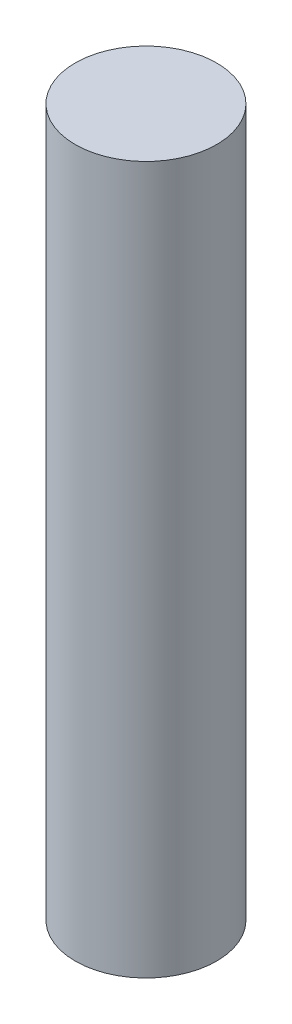
ISO-10303-21;
HEADER;
FILE_DESCRIPTION(('STEP AP214'),'2;1');
FILE_NAME('part.step','',(''),(''),'','','');
FILE_SCHEMA(('AUTOMOTIVE_DESIGN { 1 0 10303 214 1 1 1 1 }'));
ENDSEC;
DATA;
#1=APPLICATION_CONTEXT('core data for automotive mechanical design processes');
#2=APPLICATION_PROTOCOL_DEFINITION('international standard','automotive_design',2000,#1);
#3=PRODUCT_CONTEXT('',#1,'mechanical');
#4=PRODUCT('Part','Part','',(#3));
#5=PRODUCT_RELATED_PRODUCT_CATEGORY('part','',(#4));
#6=PRODUCT_DEFINITION_FORMATION('','',#4);
#7=PRODUCT_DEFINITION_CONTEXT('part definition',#1,'design');
#8=PRODUCT_DEFINITION('design','',#6,#7);
#9=PRODUCT_DEFINITION_SHAPE('','',#8);
#10=(LENGTH_UNIT() NAMED_UNIT(*) SI_UNIT(.MILLI.,.METRE.));
#11=(NAMED_UNIT(*) PLANE_ANGLE_UNIT() SI_UNIT($,.RADIAN.));
#12=(NAMED_UNIT(*) SI_UNIT($,.STERADIAN.) SOLID_ANGLE_UNIT());
#13=UNCERTAINTY_MEASURE_WITH_UNIT(LENGTH_MEASURE(1.E-05),#10,'distance_accuracy_value','');
#14=(GEOMETRIC_REPRESENTATION_CONTEXT(3) GLOBAL_UNCERTAINTY_ASSIGNED_CONTEXT((#13)) GLOBAL_UNIT_ASSIGNED_CONTEXT((#10,
#11,#12)) REPRESENTATION_CONTEXT('',''));
#15=CARTESIAN_POINT('',(0.,0.,0.));
#16=DIRECTION('',(0.,0.,1.));
#17=DIRECTION('',(1.,0.,0.));
#18=AXIS2_PLACEMENT_3D('',#15,#16,#17);
#19=CARTESIAN_POINT('',(0.,50.,0.));
#20=DIRECTION('',(0.,-1.,0.));
#21=DIRECTION('',(0.,0.,-1.));
#22=AXIS2_PLACEMENT_3D('',#19,#20,#21);
#23=CYLINDRICAL_SURFACE('',#22,5.);
#24=CARTESIAN_POINT('',(0.,50.,0.));
#25=DIRECTION('',(0.,1.,0.));
#26=DIRECTION('',(0.,0.,1.));
#27=AXIS2_PLACEMENT_3D('',#24,#25,#26);
#28=CIRCLE('',#27,5.);
#29=CARTESIAN_POINT('',(0.,50.,5.));
#30=VERTEX_POINT('',#29);
#31=EDGE_CURVE('E10',#30,#30,#28,.T.);
#32=ORIENTED_EDGE('',*,*,#31,.F.);
#33=EDGE_LOOP('',(#32));
#34=FACE_BOUND('',#33,.T.);
#35=CARTESIAN_POINT('',(0.,0.,0.));
#36=DIRECTION('',(0.,1.,0.));
#37=DIRECTION('',(0.,0.,1.));
#38=AXIS2_PLACEMENT_3D('',#35,#36,#37);
#39=CIRCLE('',#38,5.);
#40=CARTESIAN_POINT('',(0.,0.,5.));
#41=VERTEX_POINT('',#40);
#42=EDGE_CURVE('E38',#41,#41,#39,.T.);
#43=ORIENTED_EDGE('',*,*,#42,.T.);
#44=EDGE_LOOP('',(#43));
#45=FACE_BOUND('',#44,.T.);
#46=ADVANCED_FACE('F35',(#34,#45),#23,.T.);
#47=CARTESIAN_POINT('',(0.,50.,0.));
#48=DIRECTION('',(0.,1.,0.));
#49=DIRECTION('',(0.,0.,1.));
#50=AXIS2_PLACEMENT_3D('',#47,#48,#49);
#51=PLANE('',#50);
#52=ORIENTED_EDGE('',*,*,#31,.T.);
#53=EDGE_LOOP('',(#52));
#54=FACE_BOUND('',#53,.T.);
#55=ADVANCED_FACE('F50',(#54),#51,.T.);
#56=CARTESIAN_POINT('',(0.,0.,0.));
#57=DIRECTION('',(0.,1.,0.));
#58=DIRECTION('',(0.,0.,1.));
#59=AXIS2_PLACEMENT_3D('',#56,#57,#58);
#60=PLANE('',#59);
#61=ORIENTED_EDGE('',*,*,#42,.F.);
#62=EDGE_LOOP('',(#61));
#63=FACE_BOUND('',#62,.T.);
#64=ADVANCED_FACE('F48',(#63),#60,.F.);
#65=CLOSED_SHELL('',(#46,#55,#64));
#66=MANIFOLD_SOLID_BREP('B2',#65);
#67=ADVANCED_BREP_SHAPE_REPRESENTATION('',(#18,#66),#14);
#68=SHAPE_DEFINITION_REPRESENTATION(#9,#67);
ENDSEC;
END-ISO-10303-21;
